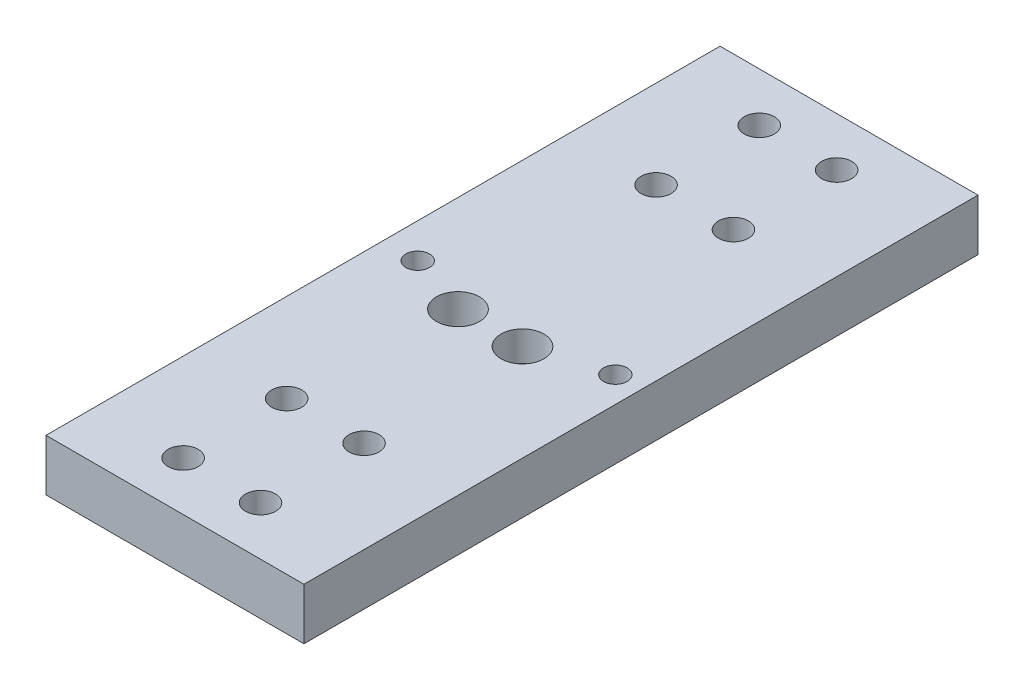
ISO-10303-21;
HEADER;
FILE_DESCRIPTION(('STEP AP214'),'2;1');
FILE_NAME('part.step','',(''),(''),'','','');
FILE_SCHEMA(('AUTOMOTIVE_DESIGN { 1 0 10303 214 1 1 1 1 }'));
ENDSEC;
DATA;
#1=APPLICATION_CONTEXT('core data for automotive mechanical design processes');
#2=APPLICATION_PROTOCOL_DEFINITION('international standard','automotive_design',2000,#1);
#3=PRODUCT_CONTEXT('',#1,'mechanical');
#4=PRODUCT('Part','Part','',(#3));
#5=PRODUCT_RELATED_PRODUCT_CATEGORY('part','',(#4));
#6=PRODUCT_DEFINITION_FORMATION('','',#4);
#7=PRODUCT_DEFINITION_CONTEXT('part definition',#1,'design');
#8=PRODUCT_DEFINITION('design','',#6,#7);
#9=PRODUCT_DEFINITION_SHAPE('','',#8);
#10=(LENGTH_UNIT() NAMED_UNIT(*) SI_UNIT(.MILLI.,.METRE.));
#11=(NAMED_UNIT(*) PLANE_ANGLE_UNIT() SI_UNIT($,.RADIAN.));
#12=(NAMED_UNIT(*) SI_UNIT($,.STERADIAN.) SOLID_ANGLE_UNIT());
#13=UNCERTAINTY_MEASURE_WITH_UNIT(LENGTH_MEASURE(1.E-05),#10,'distance_accuracy_value','');
#14=(GEOMETRIC_REPRESENTATION_CONTEXT(3) GLOBAL_UNCERTAINTY_ASSIGNED_CONTEXT((#13)) GLOBAL_UNIT_ASSIGNED_CONTEXT((#10,
#11,#12)) REPRESENTATION_CONTEXT('',''));
#15=CARTESIAN_POINT('',(0.,0.,0.));
#16=DIRECTION('',(0.,0.,1.));
#17=DIRECTION('',(1.,0.,0.));
#18=AXIS2_PLACEMENT_3D('',#15,#16,#17);
#19=CARTESIAN_POINT('',(-2.21723669139991,-0.000999999999997531,-18.6316320805192));
#20=DIRECTION('',(0.,1.,0.));
#21=DIRECTION('',(0.,0.,1.));
#22=AXIS2_PLACEMENT_3D('',#19,#20,#21);
#23=CYLINDRICAL_SURFACE('',#22,3.25);
#24=CARTESIAN_POINT('',(-2.21723669139991,0.,-18.6316320805192));
#25=DIRECTION('',(0.,-1.,0.));
#26=DIRECTION('',(0.,0.,-1.));
#27=AXIS2_PLACEMENT_3D('',#24,#25,#26);
#28=CIRCLE('',#27,3.25);
#29=CARTESIAN_POINT('',(-2.21723669139991,0.,-21.8816320805192));
#30=VERTEX_POINT('',#29);
#31=EDGE_CURVE('E134',#30,#30,#28,.F.);
#32=ORIENTED_EDGE('',*,*,#31,.F.);
#33=EDGE_LOOP('',(#32));
#34=FACE_BOUND('',#33,.T.);
#35=CARTESIAN_POINT('',(-2.21723669139991,5.,-18.6316320805192));
#36=DIRECTION('',(0.,1.,0.));
#37=DIRECTION('',(0.,0.,1.));
#38=AXIS2_PLACEMENT_3D('',#35,#36,#37);
#39=CIRCLE('',#38,3.25);
#40=CARTESIAN_POINT('',(-2.21723669139991,5.,-15.3816320805192));
#41=VERTEX_POINT('',#40);
#42=EDGE_CURVE('E38',#41,#41,#39,.F.);
#43=ORIENTED_EDGE('',*,*,#42,.F.);
#44=EDGE_LOOP('',(#43));
#45=FACE_BOUND('',#44,.T.);
#46=ADVANCED_FACE('F34',(#34,#45),#23,.F.);
#47=CARTESIAN_POINT('',(-17.2172366913999,-0.000999999999997531,-18.6316320805192));
#48=DIRECTION('',(0.,1.,0.));
#49=DIRECTION('',(0.,0.,1.));
#50=AXIS2_PLACEMENT_3D('',#47,#48,#49);
#51=CYLINDRICAL_SURFACE('',#50,3.25);
#52=CARTESIAN_POINT('',(-17.2172366913999,0.,-18.6316320805192));
#53=DIRECTION('',(0.,-1.,0.));
#54=DIRECTION('',(0.,0.,-1.));
#55=AXIS2_PLACEMENT_3D('',#52,#53,#54);
#56=CIRCLE('',#55,3.25);
#57=CARTESIAN_POINT('',(-17.2172366913999,0.,-21.8816320805192));
#58=VERTEX_POINT('',#57);
#59=EDGE_CURVE('E206',#58,#58,#56,.F.);
#60=ORIENTED_EDGE('',*,*,#59,.F.);
#61=EDGE_LOOP('',(#60));
#62=FACE_BOUND('',#61,.T.);
#63=CARTESIAN_POINT('',(-17.2172366913999,5.,-18.6316320805192));
#64=DIRECTION('',(0.,1.,0.));
#65=DIRECTION('',(0.,0.,1.));
#66=AXIS2_PLACEMENT_3D('',#63,#64,#65);
#67=CIRCLE('',#66,3.25);
#68=CARTESIAN_POINT('',(-17.2172366913999,5.,-15.3816320805192));
#69=VERTEX_POINT('',#68);
#70=EDGE_CURVE('E135',#69,#69,#67,.F.);
#71=ORIENTED_EDGE('',*,*,#70,.F.);
#72=EDGE_LOOP('',(#71));
#73=FACE_BOUND('',#72,.T.);
#74=ADVANCED_FACE('F242',(#62,#73),#51,.F.);
#75=CARTESIAN_POINT('',(-1.12699379619021,-0.000999999999997531,19.3040918790416));
#76=DIRECTION('',(0.,1.,0.));
#77=DIRECTION('',(0.,0.,1.));
#78=AXIS2_PLACEMENT_3D('',#75,#76,#77);
#79=CYLINDRICAL_SURFACE('',#78,2.25);
#80=CARTESIAN_POINT('',(-1.12699379619021,0.,19.3040918790416));
#81=DIRECTION('',(0.,-1.,0.));
#82=DIRECTION('',(0.,0.,-1.));
#83=AXIS2_PLACEMENT_3D('',#80,#81,#82);
#84=CIRCLE('',#83,2.25);
#85=CARTESIAN_POINT('',(-1.12699379619021,0.,17.0540918790416));
#86=VERTEX_POINT('',#85);
#87=EDGE_CURVE('E104',#86,#86,#84,.F.);
#88=ORIENTED_EDGE('',*,*,#87,.F.);
#89=EDGE_LOOP('',(#88));
#90=FACE_BOUND('',#89,.T.);
#91=CARTESIAN_POINT('',(-1.12699379619021,7.,19.3040918790416));
#92=DIRECTION('',(0.,1.,0.));
#93=DIRECTION('',(0.,0.,1.));
#94=AXIS2_PLACEMENT_3D('',#91,#92,#93);
#95=CIRCLE('',#94,2.25);
#96=CARTESIAN_POINT('',(-1.12699379619021,7.,21.5540918790416));
#97=VERTEX_POINT('',#96);
#98=EDGE_CURVE('E132',#97,#97,#95,.F.);
#99=ORIENTED_EDGE('',*,*,#98,.F.);
#100=EDGE_LOOP('',(#99));
#101=FACE_BOUND('',#100,.T.);
#102=ADVANCED_FACE('F238',(#90,#101),#79,.F.);
#103=CARTESIAN_POINT('',(-1.20801929958398,-0.000999999999997531,-66.6959081209584));
#104=DIRECTION('',(0.,1.,0.));
#105=DIRECTION('',(0.,0.,1.));
#106=AXIS2_PLACEMENT_3D('',#103,#104,#105);
#107=CYLINDRICAL_SURFACE('',#106,2.25);
#108=CARTESIAN_POINT('',(-1.20801929958398,0.,-66.6959081209584));
#109=DIRECTION('',(0.,-1.,0.));
#110=DIRECTION('',(0.,0.,-1.));
#111=AXIS2_PLACEMENT_3D('',#108,#109,#110);
#112=CIRCLE('',#111,2.25);
#113=CARTESIAN_POINT('',(-1.20801929958398,0.,-68.9459081209584));
#114=VERTEX_POINT('',#113);
#115=EDGE_CURVE('E209',#114,#114,#112,.F.);
#116=ORIENTED_EDGE('',*,*,#115,.F.);
#117=EDGE_LOOP('',(#116));
#118=FACE_BOUND('',#117,.T.);
#119=CARTESIAN_POINT('',(-1.20801929958398,7.,-66.6959081209584));
#120=DIRECTION('',(0.,1.,0.));
#121=DIRECTION('',(0.,0.,1.));
#122=AXIS2_PLACEMENT_3D('',#119,#120,#121);
#123=CIRCLE('',#122,2.25);
#124=CARTESIAN_POINT('',(-1.20801929958398,7.,-64.4459081209584));
#125=VERTEX_POINT('',#124);
#126=EDGE_CURVE('E129',#125,#125,#123,.F.);
#127=ORIENTED_EDGE('',*,*,#126,.F.);
#128=EDGE_LOOP('',(#127));
#129=FACE_BOUND('',#128,.T.);
#130=ADVANCED_FACE('F241',(#118,#129),#107,.F.);
#131=CARTESIAN_POINT('',(-1.20801929958398,-0.000999999999997531,-90.6959081209584));
#132=DIRECTION('',(0.,1.,0.));
#133=DIRECTION('',(0.,0.,1.));
#134=AXIS2_PLACEMENT_3D('',#131,#132,#133);
#135=CYLINDRICAL_SURFACE('',#134,2.25);
#136=CARTESIAN_POINT('',(-1.20801929958398,0.,-90.6959081209584));
#137=DIRECTION('',(0.,-1.,0.));
#138=DIRECTION('',(0.,0.,-1.));
#139=AXIS2_PLACEMENT_3D('',#136,#137,#138);
#140=CIRCLE('',#139,2.25);
#141=CARTESIAN_POINT('',(-1.20801929958398,0.,-92.9459081209584));
#142=VERTEX_POINT('',#141);
#143=EDGE_CURVE('E216',#142,#142,#140,.F.);
#144=ORIENTED_EDGE('',*,*,#143,.F.);
#145=EDGE_LOOP('',(#144));
#146=FACE_BOUND('',#145,.T.);
#147=CARTESIAN_POINT('',(-1.20801929958398,7.,-90.6959081209584));
#148=DIRECTION('',(0.,1.,0.));
#149=DIRECTION('',(0.,0.,1.));
#150=AXIS2_PLACEMENT_3D('',#147,#148,#149);
#151=CIRCLE('',#150,2.25);
#152=CARTESIAN_POINT('',(-1.20801929958398,7.,-88.4459081209584));
#153=VERTEX_POINT('',#152);
#154=EDGE_CURVE('E126',#153,#153,#151,.F.);
#155=ORIENTED_EDGE('',*,*,#154,.F.);
#156=EDGE_LOOP('',(#155));
#157=FACE_BOUND('',#156,.T.);
#158=ADVANCED_FACE('F279',(#146,#157),#135,.F.);
#159=CARTESIAN_POINT('',(-19.2081218794823,-0.000999999999997531,-90.6959081209584));
#160=DIRECTION('',(0.,1.,0.));
#161=DIRECTION('',(0.,0.,1.));
#162=AXIS2_PLACEMENT_3D('',#159,#160,#161);
#163=CYLINDRICAL_SURFACE('',#162,2.25);
#164=CARTESIAN_POINT('',(-19.2081218794823,0.,-90.6959081209584));
#165=DIRECTION('',(0.,-1.,0.));
#166=DIRECTION('',(0.,0.,-1.));
#167=AXIS2_PLACEMENT_3D('',#164,#165,#166);
#168=CIRCLE('',#167,2.25);
#169=CARTESIAN_POINT('',(-19.2081218794823,0.,-92.9459081209584));
#170=VERTEX_POINT('',#169);
#171=EDGE_CURVE('E212',#170,#170,#168,.F.);
#172=ORIENTED_EDGE('',*,*,#171,.F.);
#173=EDGE_LOOP('',(#172));
#174=FACE_BOUND('',#173,.T.);
#175=CARTESIAN_POINT('',(-19.2081218794823,7.,-90.6959081209584));
#176=DIRECTION('',(0.,1.,0.));
#177=DIRECTION('',(0.,0.,1.));
#178=AXIS2_PLACEMENT_3D('',#175,#176,#177);
#179=CIRCLE('',#178,2.25);
#180=CARTESIAN_POINT('',(-19.2081218794823,7.,-88.4459081209584));
#181=VERTEX_POINT('',#180);
#182=EDGE_CURVE('E123',#181,#181,#179,.F.);
#183=ORIENTED_EDGE('',*,*,#182,.F.);
#184=EDGE_LOOP('',(#183));
#185=FACE_BOUND('',#184,.T.);
#186=ADVANCED_FACE('F275',(#174,#185),#163,.F.);
#187=CARTESIAN_POINT('',(-19.1270963760885,-0.000999999999997531,19.3040918790416));
#188=DIRECTION('',(0.,1.,0.));
#189=DIRECTION('',(0.,0.,1.));
#190=AXIS2_PLACEMENT_3D('',#187,#188,#189);
#191=CYLINDRICAL_SURFACE('',#190,2.25);
#192=CARTESIAN_POINT('',(-19.1270963760885,0.,19.3040918790416));
#193=DIRECTION('',(0.,-1.,0.));
#194=DIRECTION('',(0.,0.,-1.));
#195=AXIS2_PLACEMENT_3D('',#192,#193,#194);
#196=CIRCLE('',#195,2.25);
#197=CARTESIAN_POINT('',(-19.1270963760885,0.,17.0540918790416));
#198=VERTEX_POINT('',#197);
#199=EDGE_CURVE('E227',#198,#198,#196,.F.);
#200=ORIENTED_EDGE('',*,*,#199,.F.);
#201=EDGE_LOOP('',(#200));
#202=FACE_BOUND('',#201,.T.);
#203=CARTESIAN_POINT('',(-19.1270963760885,7.,19.3040918790416));
#204=DIRECTION('',(0.,1.,0.));
#205=DIRECTION('',(0.,0.,1.));
#206=AXIS2_PLACEMENT_3D('',#203,#204,#205);
#207=CIRCLE('',#206,2.25);
#208=CARTESIAN_POINT('',(-19.1270963760885,7.,21.5540918790416));
#209=VERTEX_POINT('',#208);
#210=EDGE_CURVE('E120',#209,#209,#207,.F.);
#211=ORIENTED_EDGE('',*,*,#210,.F.);
#212=EDGE_LOOP('',(#211));
#213=FACE_BOUND('',#212,.T.);
#214=ADVANCED_FACE('F278',(#202,#213),#191,.F.);
#215=CARTESIAN_POINT('',(-1.20801929958398,-0.000999999999997531,43.3040918790416));
#216=DIRECTION('',(0.,1.,0.));
#217=DIRECTION('',(0.,0.,1.));
#218=AXIS2_PLACEMENT_3D('',#215,#216,#217);
#219=CYLINDRICAL_SURFACE('',#218,2.25);
#220=CARTESIAN_POINT('',(-1.20801929958398,0.,43.3040918790416));
#221=DIRECTION('',(0.,-1.,0.));
#222=DIRECTION('',(0.,0.,-1.));
#223=AXIS2_PLACEMENT_3D('',#220,#221,#222);
#224=CIRCLE('',#223,2.25);
#225=CARTESIAN_POINT('',(-1.20801929958398,0.,41.0540918790416));
#226=VERTEX_POINT('',#225);
#227=EDGE_CURVE('E224',#226,#226,#224,.F.);
#228=ORIENTED_EDGE('',*,*,#227,.F.);
#229=EDGE_LOOP('',(#228));
#230=FACE_BOUND('',#229,.T.);
#231=CARTESIAN_POINT('',(-1.20801929958398,7.,43.3040918790416));
#232=DIRECTION('',(0.,1.,0.));
#233=DIRECTION('',(0.,0.,1.));
#234=AXIS2_PLACEMENT_3D('',#231,#232,#233);
#235=CIRCLE('',#234,2.25);
#236=CARTESIAN_POINT('',(-1.20801929958398,7.,45.5540918790416));
#237=VERTEX_POINT('',#236);
#238=EDGE_CURVE('E117',#237,#237,#235,.F.);
#239=ORIENTED_EDGE('',*,*,#238,.F.);
#240=EDGE_LOOP('',(#239));
#241=FACE_BOUND('',#240,.T.);
#242=ADVANCED_FACE('F291',(#230,#241),#219,.F.);
#243=CARTESIAN_POINT('',(-19.2081218794823,-0.000999999999997531,43.3040918790416));
#244=DIRECTION('',(0.,1.,0.));
#245=DIRECTION('',(0.,0.,1.));
#246=AXIS2_PLACEMENT_3D('',#243,#244,#245);
#247=CYLINDRICAL_SURFACE('',#246,2.25);
#248=CARTESIAN_POINT('',(-19.2081218794823,0.,43.3040918790416));
#249=DIRECTION('',(0.,-1.,0.));
#250=DIRECTION('',(0.,0.,-1.));
#251=AXIS2_PLACEMENT_3D('',#248,#249,#250);
#252=CIRCLE('',#251,2.25);
#253=CARTESIAN_POINT('',(-19.2081218794823,0.,41.0540918790416));
#254=VERTEX_POINT('',#253);
#255=EDGE_CURVE('E221',#254,#254,#252,.F.);
#256=ORIENTED_EDGE('',*,*,#255,.F.);
#257=EDGE_LOOP('',(#256));
#258=FACE_BOUND('',#257,.T.);
#259=CARTESIAN_POINT('',(-19.2081218794823,7.,43.3040918790416));
#260=DIRECTION('',(0.,1.,0.));
#261=DIRECTION('',(0.,0.,1.));
#262=AXIS2_PLACEMENT_3D('',#259,#260,#261);
#263=CIRCLE('',#262,2.25);
#264=CARTESIAN_POINT('',(-19.2081218794823,7.,45.5540918790416));
#265=VERTEX_POINT('',#264);
#266=EDGE_CURVE('E113',#265,#265,#263,.F.);
#267=ORIENTED_EDGE('',*,*,#266,.F.);
#268=EDGE_LOOP('',(#267));
#269=FACE_BOUND('',#268,.T.);
#270=ADVANCED_FACE('F287',(#258,#269),#247,.F.);
#271=CARTESIAN_POINT('',(-19.2081218794823,-0.000999999999997531,-66.6959081209584));
#272=DIRECTION('',(0.,1.,0.));
#273=DIRECTION('',(0.,0.,1.));
#274=AXIS2_PLACEMENT_3D('',#271,#272,#273);
#275=CYLINDRICAL_SURFACE('',#274,2.25);
#276=CARTESIAN_POINT('',(-19.2081218794823,0.,-66.6959081209584));
#277=DIRECTION('',(0.,-1.,0.));
#278=DIRECTION('',(0.,0.,-1.));
#279=AXIS2_PLACEMENT_3D('',#276,#277,#278);
#280=CIRCLE('',#279,2.25);
#281=CARTESIAN_POINT('',(-19.2081218794823,0.,-68.9459081209584));
#282=VERTEX_POINT('',#281);
#283=EDGE_CURVE('E215',#282,#282,#280,.F.);
#284=ORIENTED_EDGE('',*,*,#283,.F.);
#285=EDGE_LOOP('',(#284));
#286=FACE_BOUND('',#285,.T.);
#287=CARTESIAN_POINT('',(-19.2081218794823,7.,-66.6959081209584));
#288=DIRECTION('',(0.,1.,0.));
#289=DIRECTION('',(0.,0.,1.));
#290=AXIS2_PLACEMENT_3D('',#287,#288,#289);
#291=CIRCLE('',#290,2.25);
#292=CARTESIAN_POINT('',(-19.2081218794823,7.,-64.4459081209584));
#293=VERTEX_POINT('',#292);
#294=EDGE_CURVE('E110',#293,#293,#291,.F.);
#295=ORIENTED_EDGE('',*,*,#294,.F.);
#296=EDGE_LOOP('',(#295));
#297=FACE_BOUND('',#296,.T.);
#298=ADVANCED_FACE('F290',(#286,#297),#275,.F.);
#299=CARTESIAN_POINT('',(20.2827633086001,12.,-102.082398322067));
#300=DIRECTION('',(0.,0.,1.));
#301=DIRECTION('',(1.,0.,0.));
#302=AXIS2_PLACEMENT_3D('',#299,#300,#301);
#303=PLANE('',#302);
#304=DIRECTION('',(-1.,0.,0.));
#305=VECTOR('',#304,1.);
#306=CARTESIAN_POINT('',(20.2827633086001,0.,-102.082398322067));
#307=LINE('',#306,#305);
#308=CARTESIAN_POINT('',(20.2827633086001,0.,-102.082398322067));
#309=VERTEX_POINT('',#308);
#310=CARTESIAN_POINT('',(-39.7172366913999,0.,-102.082398322067));
#311=VERTEX_POINT('',#310);
#312=EDGE_CURVE('E101',#309,#311,#307,.T.);
#313=ORIENTED_EDGE('',*,*,#312,.T.);
#314=DIRECTION('',(0.,-1.,0.));
#315=VECTOR('',#314,1.);
#316=CARTESIAN_POINT('',(-39.7172366913999,12.,-102.082398322067));
#317=LINE('',#316,#315);
#318=CARTESIAN_POINT('',(-39.7172366913999,12.,-102.082398322067));
#319=VERTEX_POINT('',#318);
#320=EDGE_CURVE('E11',#319,#311,#317,.T.);
#321=ORIENTED_EDGE('',*,*,#320,.F.);
#322=DIRECTION('',(-1.,0.,0.));
#323=VECTOR('',#322,1.);
#324=CARTESIAN_POINT('',(20.2827633086001,12.,-102.082398322067));
#325=LINE('',#324,#323);
#326=CARTESIAN_POINT('',(20.2827633086001,12.,-102.082398322067));
#327=VERTEX_POINT('',#326);
#328=EDGE_CURVE('E88',#327,#319,#325,.T.);
#329=ORIENTED_EDGE('',*,*,#328,.F.);
#330=DIRECTION('',(0.,-1.,0.));
#331=VECTOR('',#330,1.);
#332=CARTESIAN_POINT('',(20.2827633086001,12.,-102.082398322067));
#333=LINE('',#332,#331);
#334=EDGE_CURVE('E97',#327,#309,#333,.T.);
#335=ORIENTED_EDGE('',*,*,#334,.T.);
#336=EDGE_LOOP('',(#313,#321,#329,#335));
#337=FACE_BOUND('',#336,.T.);
#338=ADVANCED_FACE('F36',(#337),#303,.F.);
#339=CARTESIAN_POINT('',(-39.7172366913999,12.,54.6905820801503));
#340=DIRECTION('',(1.,0.,0.));
#341=DIRECTION('',(0.,0.,-1.));
#342=AXIS2_PLACEMENT_3D('',#339,#340,#341);
#343=PLANE('',#342);
#344=DIRECTION('',(0.,0.,1.));
#345=VECTOR('',#344,1.);
#346=CARTESIAN_POINT('',(-39.7172366913999,0.,54.6905820801503));
#347=LINE('',#346,#345);
#348=CARTESIAN_POINT('',(-39.7172366913999,0.,54.6905820801503));
#349=VERTEX_POINT('',#348);
#350=EDGE_CURVE('E92',#311,#349,#347,.T.);
#351=ORIENTED_EDGE('',*,*,#350,.T.);
#352=DIRECTION('',(0.,-1.,0.));
#353=VECTOR('',#352,1.);
#354=CARTESIAN_POINT('',(-39.7172366913999,12.,54.6905820801503));
#355=LINE('',#354,#353);
#356=CARTESIAN_POINT('',(-39.7172366913999,12.,54.6905820801503));
#357=VERTEX_POINT('',#356);
#358=EDGE_CURVE('E44',#357,#349,#355,.T.);
#359=ORIENTED_EDGE('',*,*,#358,.F.);
#360=DIRECTION('',(0.,0.,1.));
#361=VECTOR('',#360,1.);
#362=CARTESIAN_POINT('',(-39.7172366913999,12.,54.6905820801503));
#363=LINE('',#362,#361);
#364=EDGE_CURVE('E83',#319,#357,#363,.T.);
#365=ORIENTED_EDGE('',*,*,#364,.F.);
#366=ORIENTED_EDGE('',*,*,#320,.T.);
#367=EDGE_LOOP('',(#351,#359,#365,#366));
#368=FACE_BOUND('',#367,.T.);
#369=ADVANCED_FACE('F91',(#368),#343,.F.);
#370=CARTESIAN_POINT('',(20.2827633086001,12.,54.6905820801503));
#371=DIRECTION('',(0.,0.,-1.));
#372=DIRECTION('',(-1.,0.,0.));
#373=AXIS2_PLACEMENT_3D('',#370,#371,#372);
#374=PLANE('',#373);
#375=DIRECTION('',(1.,0.,0.));
#376=VECTOR('',#375,1.);
#377=CARTESIAN_POINT('',(20.2827633086001,0.,54.6905820801503));
#378=LINE('',#377,#376);
#379=CARTESIAN_POINT('',(20.2827633086001,0.,54.6905820801503));
#380=VERTEX_POINT('',#379);
#381=EDGE_CURVE('E70',#349,#380,#378,.T.);
#382=ORIENTED_EDGE('',*,*,#381,.T.);
#383=DIRECTION('',(0.,-1.,0.));
#384=VECTOR('',#383,1.);
#385=CARTESIAN_POINT('',(20.2827633086001,12.,54.6905820801503));
#386=LINE('',#385,#384);
#387=CARTESIAN_POINT('',(20.2827633086001,12.,54.6905820801503));
#388=VERTEX_POINT('',#387);
#389=EDGE_CURVE('E93',#388,#380,#386,.T.);
#390=ORIENTED_EDGE('',*,*,#389,.F.);
#391=DIRECTION('',(1.,0.,0.));
#392=VECTOR('',#391,1.);
#393=CARTESIAN_POINT('',(20.2827633086001,12.,54.6905820801503));
#394=LINE('',#393,#392);
#395=EDGE_CURVE('E86',#357,#388,#394,.T.);
#396=ORIENTED_EDGE('',*,*,#395,.F.);
#397=ORIENTED_EDGE('',*,*,#358,.T.);
#398=EDGE_LOOP('',(#382,#390,#396,#397));
#399=FACE_BOUND('',#398,.T.);
#400=ADVANCED_FACE('F95',(#399),#374,.F.);
#401=CARTESIAN_POINT('',(20.2827633086001,12.,54.6905820801503));
#402=DIRECTION('',(-1.,0.,0.));
#403=DIRECTION('',(0.,0.,1.));
#404=AXIS2_PLACEMENT_3D('',#401,#402,#403);
#405=PLANE('',#404);
#406=DIRECTION('',(0.,0.,-1.));
#407=VECTOR('',#406,1.);
#408=CARTESIAN_POINT('',(20.2827633086001,0.,54.6905820801503));
#409=LINE('',#408,#407);
#410=EDGE_CURVE('E76',#380,#309,#409,.T.);
#411=ORIENTED_EDGE('',*,*,#410,.T.);
#412=ORIENTED_EDGE('',*,*,#334,.F.);
#413=DIRECTION('',(0.,0.,-1.));
#414=VECTOR('',#413,1.);
#415=CARTESIAN_POINT('',(20.2827633086001,12.,54.6905820801503));
#416=LINE('',#415,#414);
#417=EDGE_CURVE('E53',#388,#327,#416,.T.);
#418=ORIENTED_EDGE('',*,*,#417,.F.);
#419=ORIENTED_EDGE('',*,*,#389,.T.);
#420=EDGE_LOOP('',(#411,#412,#418,#419));
#421=FACE_BOUND('',#420,.T.);
#422=ADVANCED_FACE('F304',(#421),#405,.F.);
#423=CARTESIAN_POINT('',(0.,12.,0.));
#424=DIRECTION('',(0.,-1.,0.));
#425=DIRECTION('',(0.,0.,-1.));
#426=AXIS2_PLACEMENT_3D('',#423,#424,#425);
#427=PLANE('',#426);
#428=CARTESIAN_POINT('',(-31.6578801152564,12.,-23.7018446066276));
#429=DIRECTION('',(0.,1.,0.));
#430=DIRECTION('',(0.,0.,1.));
#431=AXIS2_PLACEMENT_3D('',#428,#429,#430);
#432=CIRCLE('',#431,2.74999999999921);
#433=CARTESIAN_POINT('',(-31.6578801152564,12.,-20.9518446066284));
#434=VERTEX_POINT('',#433);
#435=EDGE_CURVE('E159',#434,#434,#432,.T.);
#436=ORIENTED_EDGE('',*,*,#435,.F.);
#437=EDGE_LOOP('',(#436));
#438=FACE_BOUND('',#437,.T.);
#439=CARTESIAN_POINT('',(14.2827323819613,12.,-23.7356842543893));
#440=DIRECTION('',(0.,1.,0.));
#441=DIRECTION('',(0.,0.,1.));
#442=AXIS2_PLACEMENT_3D('',#439,#440,#441);
#443=CIRCLE('',#442,2.75);
#444=CARTESIAN_POINT('',(14.2827323819613,12.,-20.9856842543893));
#445=VERTEX_POINT('',#444);
#446=EDGE_CURVE('E652',#445,#445,#443,.T.);
#447=ORIENTED_EDGE('',*,*,#446,.F.);
#448=EDGE_LOOP('',(#447));
#449=FACE_BOUND('',#448,.T.);
#450=CARTESIAN_POINT('',(-17.2172366913999,12.,-18.6316320805192));
#451=DIRECTION('',(0.,1.,0.));
#452=DIRECTION('',(0.,0.,1.));
#453=AXIS2_PLACEMENT_3D('',#450,#451,#452);
#454=CIRCLE('',#453,5.);
#455=CARTESIAN_POINT('',(-17.2172366913999,12.,-13.6316320805192));
#456=VERTEX_POINT('',#455);
#457=EDGE_CURVE('E143',#456,#456,#454,.T.);
#458=ORIENTED_EDGE('',*,*,#457,.F.);
#459=EDGE_LOOP('',(#458));
#460=FACE_BOUND('',#459,.T.);
#461=CARTESIAN_POINT('',(-2.21723669139991,12.,-18.6316320805192));
#462=DIRECTION('',(0.,1.,0.));
#463=DIRECTION('',(0.,0.,1.));
#464=AXIS2_PLACEMENT_3D('',#461,#462,#463);
#465=CIRCLE('',#464,5.);
#466=CARTESIAN_POINT('',(-2.21723669139991,12.,-13.6316320805192));
#467=VERTEX_POINT('',#466);
#468=EDGE_CURVE('E156',#467,#467,#465,.T.);
#469=ORIENTED_EDGE('',*,*,#468,.F.);
#470=EDGE_LOOP('',(#469));
#471=FACE_BOUND('',#470,.T.);
#472=CARTESIAN_POINT('',(-19.2081218794823,12.,43.3040918790416));
#473=DIRECTION('',(0.,1.,0.));
#474=DIRECTION('',(0.,0.,1.));
#475=AXIS2_PLACEMENT_3D('',#472,#473,#474);
#476=CIRCLE('',#475,3.5);
#477=CARTESIAN_POINT('',(-19.2081218794823,12.,46.8040918790416));
#478=VERTEX_POINT('',#477);
#479=EDGE_CURVE('E182',#478,#478,#476,.T.);
#480=ORIENTED_EDGE('',*,*,#479,.F.);
#481=EDGE_LOOP('',(#480));
#482=FACE_BOUND('',#481,.T.);
#483=CARTESIAN_POINT('',(-1.20801929958398,12.,43.3040918790416));
#484=DIRECTION('',(0.,1.,0.));
#485=DIRECTION('',(0.,0.,1.));
#486=AXIS2_PLACEMENT_3D('',#483,#484,#485);
#487=CIRCLE('',#486,3.5);
#488=CARTESIAN_POINT('',(-1.20801929958398,12.,46.8040918790416));
#489=VERTEX_POINT('',#488);
#490=EDGE_CURVE('E188',#489,#489,#487,.T.);
#491=ORIENTED_EDGE('',*,*,#490,.F.);
#492=EDGE_LOOP('',(#491));
#493=FACE_BOUND('',#492,.T.);
#494=CARTESIAN_POINT('',(-1.12699379619021,12.,19.3040918790416));
#495=DIRECTION('',(0.,1.,0.));
#496=DIRECTION('',(0.,0.,1.));
#497=AXIS2_PLACEMENT_3D('',#494,#495,#496);
#498=CIRCLE('',#497,3.5);
#499=CARTESIAN_POINT('',(-1.12699379619021,12.,22.8040918790416));
#500=VERTEX_POINT('',#499);
#501=EDGE_CURVE('E194',#500,#500,#498,.T.);
#502=ORIENTED_EDGE('',*,*,#501,.F.);
#503=EDGE_LOOP('',(#502));
#504=FACE_BOUND('',#503,.T.);
#505=CARTESIAN_POINT('',(-1.20801929958398,12.,-66.6959081209584));
#506=DIRECTION('',(0.,1.,0.));
#507=DIRECTION('',(0.,0.,1.));
#508=AXIS2_PLACEMENT_3D('',#505,#506,#507);
#509=CIRCLE('',#508,3.5);
#510=CARTESIAN_POINT('',(-1.20801929958398,12.,-63.1959081209584));
#511=VERTEX_POINT('',#510);
#512=EDGE_CURVE('E163',#511,#511,#509,.T.);
#513=ORIENTED_EDGE('',*,*,#512,.F.);
#514=EDGE_LOOP('',(#513));
#515=FACE_BOUND('',#514,.T.);
#516=CARTESIAN_POINT('',(-19.2081218794823,12.,-66.6959081209584));
#517=DIRECTION('',(0.,1.,0.));
#518=DIRECTION('',(0.,0.,1.));
#519=AXIS2_PLACEMENT_3D('',#516,#517,#518);
#520=CIRCLE('',#519,3.5);
#521=CARTESIAN_POINT('',(-19.2081218794823,12.,-63.1959081209584));
#522=VERTEX_POINT('',#521);
#523=EDGE_CURVE('E164',#522,#522,#520,.T.);
#524=ORIENTED_EDGE('',*,*,#523,.F.);
#525=EDGE_LOOP('',(#524));
#526=FACE_BOUND('',#525,.T.);
#527=CARTESIAN_POINT('',(-19.2081218794823,12.,-90.6959081209584));
#528=DIRECTION('',(0.,1.,0.));
#529=DIRECTION('',(0.,0.,1.));
#530=AXIS2_PLACEMENT_3D('',#527,#528,#529);
#531=CIRCLE('',#530,3.5);
#532=CARTESIAN_POINT('',(-19.2081218794823,12.,-87.1959081209584));
#533=VERTEX_POINT('',#532);
#534=EDGE_CURVE('E170',#533,#533,#531,.T.);
#535=ORIENTED_EDGE('',*,*,#534,.F.);
#536=EDGE_LOOP('',(#535));
#537=FACE_BOUND('',#536,.T.);
#538=CARTESIAN_POINT('',(-1.20801929958398,12.,-90.6959081209584));
#539=DIRECTION('',(0.,1.,0.));
#540=DIRECTION('',(0.,0.,1.));
#541=AXIS2_PLACEMENT_3D('',#538,#539,#540);
#542=CIRCLE('',#541,3.5);
#543=CARTESIAN_POINT('',(-1.20801929958398,12.,-87.1959081209583));
#544=VERTEX_POINT('',#543);
#545=EDGE_CURVE('E141',#544,#544,#542,.T.);
#546=ORIENTED_EDGE('',*,*,#545,.F.);
#547=EDGE_LOOP('',(#546));
#548=FACE_BOUND('',#547,.T.);
#549=CARTESIAN_POINT('',(-19.1270963760885,12.,19.3040918790416));
#550=DIRECTION('',(0.,1.,0.));
#551=DIRECTION('',(0.,0.,1.));
#552=AXIS2_PLACEMENT_3D('',#549,#550,#551);
#553=CIRCLE('',#552,3.5);
#554=CARTESIAN_POINT('',(-19.1270963760885,12.,22.8040918790416));
#555=VERTEX_POINT('',#554);
#556=EDGE_CURVE('E181',#555,#555,#553,.T.);
#557=ORIENTED_EDGE('',*,*,#556,.F.);
#558=EDGE_LOOP('',(#557));
#559=FACE_BOUND('',#558,.T.);
#560=ORIENTED_EDGE('',*,*,#328,.T.);
#561=ORIENTED_EDGE('',*,*,#364,.T.);
#562=ORIENTED_EDGE('',*,*,#395,.T.);
#563=ORIENTED_EDGE('',*,*,#417,.T.);
#564=EDGE_LOOP('',(#560,#561,#562,#563));
#565=FACE_BOUND('',#564,.T.);
#566=ADVANCED_FACE('F84',(#438,#449,#460,#471,#482,#493,#504,#515,#526,#537,#548,#559,#565),
#427,.F.);
#567=CARTESIAN_POINT('',(0.,0.,0.));
#568=DIRECTION('',(0.,-1.,0.));
#569=DIRECTION('',(0.,0.,-1.));
#570=AXIS2_PLACEMENT_3D('',#567,#568,#569);
#571=PLANE('',#570);
#572=CARTESIAN_POINT('',(-31.6578801152564,0.,-23.7018446066276));
#573=DIRECTION('',(0.,-1.,0.));
#574=DIRECTION('',(0.,0.,-1.));
#575=AXIS2_PLACEMENT_3D('',#572,#573,#574);
#576=CIRCLE('',#575,2.74999999999921);
#577=CARTESIAN_POINT('',(-31.6578801152564,0.,-26.4518446066268));
#578=VERTEX_POINT('',#577);
#579=EDGE_CURVE('E648',#578,#578,#576,.F.);
#580=ORIENTED_EDGE('',*,*,#579,.T.);
#581=EDGE_LOOP('',(#580));
#582=FACE_BOUND('',#581,.T.);
#583=CARTESIAN_POINT('',(14.2827323819613,0.,-23.7356842543893));
#584=DIRECTION('',(0.,-1.,0.));
#585=DIRECTION('',(0.,0.,-1.));
#586=AXIS2_PLACEMENT_3D('',#583,#584,#585);
#587=CIRCLE('',#586,2.75);
#588=CARTESIAN_POINT('',(14.2827323819613,0.,-26.4856842543893));
#589=VERTEX_POINT('',#588);
#590=EDGE_CURVE('E151',#589,#589,#587,.F.);
#591=ORIENTED_EDGE('',*,*,#590,.T.);
#592=EDGE_LOOP('',(#591));
#593=FACE_BOUND('',#592,.T.);
#594=ORIENTED_EDGE('',*,*,#59,.T.);
#595=EDGE_LOOP('',(#594));
#596=FACE_BOUND('',#595,.T.);
#597=ORIENTED_EDGE('',*,*,#31,.T.);
#598=EDGE_LOOP('',(#597));
#599=FACE_BOUND('',#598,.T.);
#600=ORIENTED_EDGE('',*,*,#283,.T.);
#601=EDGE_LOOP('',(#600));
#602=FACE_BOUND('',#601,.T.);
#603=ORIENTED_EDGE('',*,*,#255,.T.);
#604=EDGE_LOOP('',(#603));
#605=FACE_BOUND('',#604,.T.);
#606=ORIENTED_EDGE('',*,*,#227,.T.);
#607=EDGE_LOOP('',(#606));
#608=FACE_BOUND('',#607,.T.);
#609=ORIENTED_EDGE('',*,*,#199,.T.);
#610=EDGE_LOOP('',(#609));
#611=FACE_BOUND('',#610,.T.);
#612=ORIENTED_EDGE('',*,*,#171,.T.);
#613=EDGE_LOOP('',(#612));
#614=FACE_BOUND('',#613,.T.);
#615=ORIENTED_EDGE('',*,*,#143,.T.);
#616=EDGE_LOOP('',(#615));
#617=FACE_BOUND('',#616,.T.);
#618=ORIENTED_EDGE('',*,*,#115,.T.);
#619=EDGE_LOOP('',(#618));
#620=FACE_BOUND('',#619,.T.);
#621=ORIENTED_EDGE('',*,*,#87,.T.);
#622=EDGE_LOOP('',(#621));
#623=FACE_BOUND('',#622,.T.);
#624=ORIENTED_EDGE('',*,*,#312,.F.);
#625=ORIENTED_EDGE('',*,*,#410,.F.);
#626=ORIENTED_EDGE('',*,*,#381,.F.);
#627=ORIENTED_EDGE('',*,*,#350,.F.);
#628=EDGE_LOOP('',(#624,#625,#626,#627));
#629=FACE_BOUND('',#628,.T.);
#630=ADVANCED_FACE('F235',(#582,#593,#596,#599,#602,#605,#608,#611,#614,#617,#620,#623,#629),
#571,.T.);
#631=CARTESIAN_POINT('',(-19.2081218794823,7.,-66.6959081209584));
#632=DIRECTION('',(0.,1.,0.));
#633=DIRECTION('',(0.,0.,1.));
#634=AXIS2_PLACEMENT_3D('',#631,#632,#633);
#635=PLANE('',#634);
#636=CARTESIAN_POINT('',(-19.2081218794823,7.,-66.6959081209584));
#637=DIRECTION('',(0.,1.,0.));
#638=DIRECTION('',(0.,0.,1.));
#639=AXIS2_PLACEMENT_3D('',#636,#637,#638);
#640=CIRCLE('',#639,3.5);
#641=CARTESIAN_POINT('',(-19.2081218794823,7.,-63.1959081209584));
#642=VERTEX_POINT('',#641);
#643=EDGE_CURVE('E160',#642,#642,#640,.T.);
#644=ORIENTED_EDGE('',*,*,#643,.T.);
#645=EDGE_LOOP('',(#644));
#646=FACE_BOUND('',#645,.T.);
#647=ORIENTED_EDGE('',*,*,#294,.T.);
#648=EDGE_LOOP('',(#647));
#649=FACE_BOUND('',#648,.T.);
#650=ADVANCED_FACE('F308',(#646,#649),#635,.T.);
#651=CARTESIAN_POINT('',(-19.2081218794823,7.,-66.6959081209584));
#652=DIRECTION('',(0.,1.,0.));
#653=DIRECTION('',(0.,0.,1.));
#654=AXIS2_PLACEMENT_3D('',#651,#652,#653);
#655=CYLINDRICAL_SURFACE('',#654,3.5);
#656=ORIENTED_EDGE('',*,*,#643,.F.);
#657=EDGE_LOOP('',(#656));
#658=FACE_BOUND('',#657,.T.);
#659=ORIENTED_EDGE('',*,*,#523,.T.);
#660=EDGE_LOOP('',(#659));
#661=FACE_BOUND('',#660,.T.);
#662=ADVANCED_FACE('F443',(#658,#661),#655,.F.);
#663=CARTESIAN_POINT('',(-19.2081218794823,7.,43.3040918790416));
#664=DIRECTION('',(0.,1.,0.));
#665=DIRECTION('',(0.,0.,1.));
#666=AXIS2_PLACEMENT_3D('',#663,#664,#665);
#667=PLANE('',#666);
#668=CARTESIAN_POINT('',(-19.2081218794823,7.,43.3040918790416));
#669=DIRECTION('',(0.,1.,0.));
#670=DIRECTION('',(0.,0.,1.));
#671=AXIS2_PLACEMENT_3D('',#668,#669,#670);
#672=CIRCLE('',#671,3.5);
#673=CARTESIAN_POINT('',(-19.2081218794823,7.,46.8040918790416));
#674=VERTEX_POINT('',#673);
#675=EDGE_CURVE('E178',#674,#674,#672,.T.);
#676=ORIENTED_EDGE('',*,*,#675,.T.);
#677=EDGE_LOOP('',(#676));
#678=FACE_BOUND('',#677,.T.);
#679=ORIENTED_EDGE('',*,*,#266,.T.);
#680=EDGE_LOOP('',(#679));
#681=FACE_BOUND('',#680,.T.);
#682=ADVANCED_FACE('F447',(#678,#681),#667,.T.);
#683=CARTESIAN_POINT('',(-19.2081218794823,7.,43.3040918790416));
#684=DIRECTION('',(0.,1.,0.));
#685=DIRECTION('',(0.,0.,1.));
#686=AXIS2_PLACEMENT_3D('',#683,#684,#685);
#687=CYLINDRICAL_SURFACE('',#686,3.5);
#688=ORIENTED_EDGE('',*,*,#675,.F.);
#689=EDGE_LOOP('',(#688));
#690=FACE_BOUND('',#689,.T.);
#691=ORIENTED_EDGE('',*,*,#479,.T.);
#692=EDGE_LOOP('',(#691));
#693=FACE_BOUND('',#692,.T.);
#694=ADVANCED_FACE('F468',(#690,#693),#687,.F.);
#695=CARTESIAN_POINT('',(-1.20801929958398,7.,43.3040918790416));
#696=DIRECTION('',(0.,1.,0.));
#697=DIRECTION('',(0.,0.,1.));
#698=AXIS2_PLACEMENT_3D('',#695,#696,#697);
#699=PLANE('',#698);
#700=CARTESIAN_POINT('',(-1.20801929958398,7.,43.3040918790416));
#701=DIRECTION('',(0.,1.,0.));
#702=DIRECTION('',(0.,0.,1.));
#703=AXIS2_PLACEMENT_3D('',#700,#701,#702);
#704=CIRCLE('',#703,3.5);
#705=CARTESIAN_POINT('',(-1.20801929958398,7.,46.8040918790416));
#706=VERTEX_POINT('',#705);
#707=EDGE_CURVE('E185',#706,#706,#704,.T.);
#708=ORIENTED_EDGE('',*,*,#707,.T.);
#709=EDGE_LOOP('',(#708));
#710=FACE_BOUND('',#709,.T.);
#711=ORIENTED_EDGE('',*,*,#238,.T.);
#712=EDGE_LOOP('',(#711));
#713=FACE_BOUND('',#712,.T.);
#714=ADVANCED_FACE('F472',(#710,#713),#699,.T.);
#715=CARTESIAN_POINT('',(-1.20801929958398,7.,43.3040918790416));
#716=DIRECTION('',(0.,1.,0.));
#717=DIRECTION('',(0.,0.,1.));
#718=AXIS2_PLACEMENT_3D('',#715,#716,#717);
#719=CYLINDRICAL_SURFACE('',#718,3.5);
#720=ORIENTED_EDGE('',*,*,#707,.F.);
#721=EDGE_LOOP('',(#720));
#722=FACE_BOUND('',#721,.T.);
#723=ORIENTED_EDGE('',*,*,#490,.T.);
#724=EDGE_LOOP('',(#723));
#725=FACE_BOUND('',#724,.T.);
#726=ADVANCED_FACE('F475',(#722,#725),#719,.F.);
#727=CARTESIAN_POINT('',(-19.1270963760885,7.,19.3040918790416));
#728=DIRECTION('',(0.,1.,0.));
#729=DIRECTION('',(0.,0.,1.));
#730=AXIS2_PLACEMENT_3D('',#727,#728,#729);
#731=PLANE('',#730);
#732=CARTESIAN_POINT('',(-19.1270963760885,7.,19.3040918790416));
#733=DIRECTION('',(0.,1.,0.));
#734=DIRECTION('',(0.,0.,1.));
#735=AXIS2_PLACEMENT_3D('',#732,#733,#734);
#736=CIRCLE('',#735,3.5);
#737=CARTESIAN_POINT('',(-19.1270963760885,7.,22.8040918790416));
#738=VERTEX_POINT('',#737);
#739=EDGE_CURVE('E114',#738,#738,#736,.T.);
#740=ORIENTED_EDGE('',*,*,#739,.T.);
#741=EDGE_LOOP('',(#740));
#742=FACE_BOUND('',#741,.T.);
#743=ORIENTED_EDGE('',*,*,#210,.T.);
#744=EDGE_LOOP('',(#743));
#745=FACE_BOUND('',#744,.T.);
#746=ADVANCED_FACE('F478',(#742,#745),#731,.T.);
#747=CARTESIAN_POINT('',(-19.1270963760885,7.,19.3040918790416));
#748=DIRECTION('',(0.,1.,0.));
#749=DIRECTION('',(0.,0.,1.));
#750=AXIS2_PLACEMENT_3D('',#747,#748,#749);
#751=CYLINDRICAL_SURFACE('',#750,3.5);
#752=ORIENTED_EDGE('',*,*,#739,.F.);
#753=EDGE_LOOP('',(#752));
#754=FACE_BOUND('',#753,.T.);
#755=ORIENTED_EDGE('',*,*,#556,.T.);
#756=EDGE_LOOP('',(#755));
#757=FACE_BOUND('',#756,.T.);
#758=ADVANCED_FACE('F453',(#754,#757),#751,.F.);
#759=CARTESIAN_POINT('',(-19.2081218794823,7.,-90.6959081209584));
#760=DIRECTION('',(0.,1.,0.));
#761=DIRECTION('',(0.,0.,1.));
#762=AXIS2_PLACEMENT_3D('',#759,#760,#761);
#763=PLANE('',#762);
#764=CARTESIAN_POINT('',(-19.2081218794823,7.,-90.6959081209584));
#765=DIRECTION('',(0.,1.,0.));
#766=DIRECTION('',(0.,0.,1.));
#767=AXIS2_PLACEMENT_3D('',#764,#765,#766);
#768=CIRCLE('',#767,3.5);
#769=CARTESIAN_POINT('',(-19.2081218794823,7.,-87.1959081209584));
#770=VERTEX_POINT('',#769);
#771=EDGE_CURVE('E167',#770,#770,#768,.T.);
#772=ORIENTED_EDGE('',*,*,#771,.T.);
#773=EDGE_LOOP('',(#772));
#774=FACE_BOUND('',#773,.T.);
#775=ORIENTED_EDGE('',*,*,#182,.T.);
#776=EDGE_LOOP('',(#775));
#777=FACE_BOUND('',#776,.T.);
#778=ADVANCED_FACE('F449',(#774,#777),#763,.T.);
#779=CARTESIAN_POINT('',(-19.2081218794823,7.,-90.6959081209584));
#780=DIRECTION('',(0.,1.,0.));
#781=DIRECTION('',(0.,0.,1.));
#782=AXIS2_PLACEMENT_3D('',#779,#780,#781);
#783=CYLINDRICAL_SURFACE('',#782,3.5);
#784=ORIENTED_EDGE('',*,*,#771,.F.);
#785=EDGE_LOOP('',(#784));
#786=FACE_BOUND('',#785,.T.);
#787=ORIENTED_EDGE('',*,*,#534,.T.);
#788=EDGE_LOOP('',(#787));
#789=FACE_BOUND('',#788,.T.);
#790=ADVANCED_FACE('F452',(#786,#789),#783,.F.);
#791=CARTESIAN_POINT('',(-1.20801929958398,7.,-90.6959081209584));
#792=DIRECTION('',(0.,1.,0.));
#793=DIRECTION('',(0.,0.,1.));
#794=AXIS2_PLACEMENT_3D('',#791,#792,#793);
#795=PLANE('',#794);
#796=CARTESIAN_POINT('',(-1.20801929958398,7.,-90.6959081209584));
#797=DIRECTION('',(0.,1.,0.));
#798=DIRECTION('',(0.,0.,1.));
#799=AXIS2_PLACEMENT_3D('',#796,#797,#798);
#800=CIRCLE('',#799,3.5);
#801=CARTESIAN_POINT('',(-1.20801929958398,7.,-87.1959081209583));
#802=VERTEX_POINT('',#801);
#803=EDGE_CURVE('E173',#802,#802,#800,.T.);
#804=ORIENTED_EDGE('',*,*,#803,.T.);
#805=EDGE_LOOP('',(#804));
#806=FACE_BOUND('',#805,.T.);
#807=ORIENTED_EDGE('',*,*,#154,.T.);
#808=EDGE_LOOP('',(#807));
#809=FACE_BOUND('',#808,.T.);
#810=ADVANCED_FACE('F457',(#806,#809),#795,.T.);
#811=CARTESIAN_POINT('',(-1.20801929958398,7.,-90.6959081209584));
#812=DIRECTION('',(0.,1.,0.));
#813=DIRECTION('',(0.,0.,1.));
#814=AXIS2_PLACEMENT_3D('',#811,#812,#813);
#815=CYLINDRICAL_SURFACE('',#814,3.5);
#816=ORIENTED_EDGE('',*,*,#803,.F.);
#817=EDGE_LOOP('',(#816));
#818=FACE_BOUND('',#817,.T.);
#819=ORIENTED_EDGE('',*,*,#545,.T.);
#820=EDGE_LOOP('',(#819));
#821=FACE_BOUND('',#820,.T.);
#822=ADVANCED_FACE('F461',(#818,#821),#815,.F.);
#823=CARTESIAN_POINT('',(-1.20801929958398,7.,-66.6959081209584));
#824=DIRECTION('',(0.,1.,0.));
#825=DIRECTION('',(0.,0.,1.));
#826=AXIS2_PLACEMENT_3D('',#823,#824,#825);
#827=PLANE('',#826);
#828=CARTESIAN_POINT('',(-1.20801929958398,7.,-66.6959081209584));
#829=DIRECTION('',(0.,1.,0.));
#830=DIRECTION('',(0.,0.,1.));
#831=AXIS2_PLACEMENT_3D('',#828,#829,#830);
#832=CIRCLE('',#831,3.5);
#833=CARTESIAN_POINT('',(-1.20801929958398,7.,-63.1959081209584));
#834=VERTEX_POINT('',#833);
#835=EDGE_CURVE('E197',#834,#834,#832,.T.);
#836=ORIENTED_EDGE('',*,*,#835,.T.);
#837=EDGE_LOOP('',(#836));
#838=FACE_BOUND('',#837,.T.);
#839=ORIENTED_EDGE('',*,*,#126,.T.);
#840=EDGE_LOOP('',(#839));
#841=FACE_BOUND('',#840,.T.);
#842=ADVANCED_FACE('F259',(#838,#841),#827,.T.);
#843=CARTESIAN_POINT('',(-1.20801929958398,7.,-66.6959081209584));
#844=DIRECTION('',(0.,1.,0.));
#845=DIRECTION('',(0.,0.,1.));
#846=AXIS2_PLACEMENT_3D('',#843,#844,#845);
#847=CYLINDRICAL_SURFACE('',#846,3.5);
#848=ORIENTED_EDGE('',*,*,#835,.F.);
#849=EDGE_LOOP('',(#848));
#850=FACE_BOUND('',#849,.T.);
#851=ORIENTED_EDGE('',*,*,#512,.T.);
#852=EDGE_LOOP('',(#851));
#853=FACE_BOUND('',#852,.T.);
#854=ADVANCED_FACE('F249',(#850,#853),#847,.F.);
#855=CARTESIAN_POINT('',(-1.12699379619021,7.,19.3040918790416));
#856=DIRECTION('',(0.,1.,0.));
#857=DIRECTION('',(0.,0.,1.));
#858=AXIS2_PLACEMENT_3D('',#855,#856,#857);
#859=PLANE('',#858);
#860=CARTESIAN_POINT('',(-1.12699379619021,7.,19.3040918790416));
#861=DIRECTION('',(0.,1.,0.));
#862=DIRECTION('',(0.,0.,1.));
#863=AXIS2_PLACEMENT_3D('',#860,#861,#862);
#864=CIRCLE('',#863,3.5);
#865=CARTESIAN_POINT('',(-1.12699379619021,7.,22.8040918790416));
#866=VERTEX_POINT('',#865);
#867=EDGE_CURVE('E191',#866,#866,#864,.T.);
#868=ORIENTED_EDGE('',*,*,#867,.T.);
#869=EDGE_LOOP('',(#868));
#870=FACE_BOUND('',#869,.T.);
#871=ORIENTED_EDGE('',*,*,#98,.T.);
#872=EDGE_LOOP('',(#871));
#873=FACE_BOUND('',#872,.T.);
#874=ADVANCED_FACE('F246',(#870,#873),#859,.T.);
#875=CARTESIAN_POINT('',(-1.12699379619021,7.,19.3040918790416));
#876=DIRECTION('',(0.,1.,0.));
#877=DIRECTION('',(0.,0.,1.));
#878=AXIS2_PLACEMENT_3D('',#875,#876,#877);
#879=CYLINDRICAL_SURFACE('',#878,3.5);
#880=ORIENTED_EDGE('',*,*,#867,.F.);
#881=EDGE_LOOP('',(#880));
#882=FACE_BOUND('',#881,.T.);
#883=ORIENTED_EDGE('',*,*,#501,.T.);
#884=EDGE_LOOP('',(#883));
#885=FACE_BOUND('',#884,.T.);
#886=ADVANCED_FACE('F248',(#882,#885),#879,.F.);
#887=CARTESIAN_POINT('',(-17.2172366913999,5.,-18.6316320805192));
#888=DIRECTION('',(0.,1.,0.));
#889=DIRECTION('',(0.,0.,1.));
#890=AXIS2_PLACEMENT_3D('',#887,#888,#889);
#891=PLANE('',#890);
#892=CARTESIAN_POINT('',(-17.2172366913999,5.,-18.6316320805192));
#893=DIRECTION('',(0.,1.,0.));
#894=DIRECTION('',(0.,0.,1.));
#895=AXIS2_PLACEMENT_3D('',#892,#893,#894);
#896=CIRCLE('',#895,5.);
#897=CARTESIAN_POINT('',(-17.2172366913999,5.,-13.6316320805192));
#898=VERTEX_POINT('',#897);
#899=EDGE_CURVE('E137',#898,#898,#896,.T.);
#900=ORIENTED_EDGE('',*,*,#899,.T.);
#901=EDGE_LOOP('',(#900));
#902=FACE_BOUND('',#901,.T.);
#903=ORIENTED_EDGE('',*,*,#70,.T.);
#904=EDGE_LOOP('',(#903));
#905=FACE_BOUND('',#904,.T.);
#906=ADVANCED_FACE('F256',(#902,#905),#891,.T.);
#907=CARTESIAN_POINT('',(-17.2172366913999,5.,-18.6316320805192));
#908=DIRECTION('',(0.,1.,0.));
#909=DIRECTION('',(0.,0.,1.));
#910=AXIS2_PLACEMENT_3D('',#907,#908,#909);
#911=CYLINDRICAL_SURFACE('',#910,5.);
#912=ORIENTED_EDGE('',*,*,#899,.F.);
#913=EDGE_LOOP('',(#912));
#914=FACE_BOUND('',#913,.T.);
#915=ORIENTED_EDGE('',*,*,#457,.T.);
#916=EDGE_LOOP('',(#915));
#917=FACE_BOUND('',#916,.T.);
#918=ADVANCED_FACE('F372',(#914,#917),#911,.F.);
#919=CARTESIAN_POINT('',(-2.21723669139991,5.,-18.6316320805192));
#920=DIRECTION('',(0.,1.,0.));
#921=DIRECTION('',(0.,0.,1.));
#922=AXIS2_PLACEMENT_3D('',#919,#920,#921);
#923=PLANE('',#922);
#924=CARTESIAN_POINT('',(-2.21723669139991,5.,-18.6316320805192));
#925=DIRECTION('',(0.,1.,0.));
#926=DIRECTION('',(0.,0.,1.));
#927=AXIS2_PLACEMENT_3D('',#924,#925,#926);
#928=CIRCLE('',#927,5.);
#929=CARTESIAN_POINT('',(-2.21723669139991,5.,-13.6316320805192));
#930=VERTEX_POINT('',#929);
#931=EDGE_CURVE('E148',#930,#930,#928,.T.);
#932=ORIENTED_EDGE('',*,*,#931,.T.);
#933=EDGE_LOOP('',(#932));
#934=FACE_BOUND('',#933,.T.);
#935=ORIENTED_EDGE('',*,*,#42,.T.);
#936=EDGE_LOOP('',(#935));
#937=FACE_BOUND('',#936,.T.);
#938=ADVANCED_FACE('F381',(#934,#937),#923,.T.);
#939=CARTESIAN_POINT('',(-2.21723669139991,5.,-18.6316320805192));
#940=DIRECTION('',(0.,1.,0.));
#941=DIRECTION('',(0.,0.,1.));
#942=AXIS2_PLACEMENT_3D('',#939,#940,#941);
#943=CYLINDRICAL_SURFACE('',#942,5.);
#944=ORIENTED_EDGE('',*,*,#931,.F.);
#945=EDGE_LOOP('',(#944));
#946=FACE_BOUND('',#945,.T.);
#947=ORIENTED_EDGE('',*,*,#468,.T.);
#948=EDGE_LOOP('',(#947));
#949=FACE_BOUND('',#948,.T.);
#950=ADVANCED_FACE('F391',(#946,#949),#943,.F.);
#951=CARTESIAN_POINT('',(14.2827323819613,-0.000999999999997531,-23.7356842543893));
#952=DIRECTION('',(0.,1.,0.));
#953=DIRECTION('',(0.,0.,1.));
#954=AXIS2_PLACEMENT_3D('',#951,#952,#953);
#955=CYLINDRICAL_SURFACE('',#954,2.75);
#956=ORIENTED_EDGE('',*,*,#590,.F.);
#957=EDGE_LOOP('',(#956));
#958=FACE_BOUND('',#957,.T.);
#959=ORIENTED_EDGE('',*,*,#446,.T.);
#960=EDGE_LOOP('',(#959));
#961=FACE_BOUND('',#960,.T.);
#962=ADVANCED_FACE('F401',(#958,#961),#955,.F.);
#963=CARTESIAN_POINT('',(-31.6578801152564,-0.000999999999997531,-23.7018446066276));
#964=DIRECTION('',(0.,1.,0.));
#965=DIRECTION('',(0.,0.,1.));
#966=AXIS2_PLACEMENT_3D('',#963,#964,#965);
#967=CYLINDRICAL_SURFACE('',#966,2.74999999999921);
#968=ORIENTED_EDGE('',*,*,#579,.F.);
#969=EDGE_LOOP('',(#968));
#970=FACE_BOUND('',#969,.T.);
#971=ORIENTED_EDGE('',*,*,#435,.T.);
#972=EDGE_LOOP('',(#971));
#973=FACE_BOUND('',#972,.T.);
#974=ADVANCED_FACE('F425',(#970,#973),#967,.F.);
#975=CLOSED_SHELL('',(#46,#74,#102,#130,#158,#186,#214,#242,#270,#298,#338,#369,#400,#422,#566,
#630,#650,#662,#682,#694,#714,#726,#746,#758,#778,#790,#810,#822,#842,#854,#874,#886,#906,#918,
#938,#950,#962,#974));
#976=MANIFOLD_SOLID_BREP('B2',#975);
#977=ADVANCED_BREP_SHAPE_REPRESENTATION('',(#18,#976),#14);
#978=SHAPE_DEFINITION_REPRESENTATION(#9,#977);
ENDSEC;
END-ISO-10303-21;
